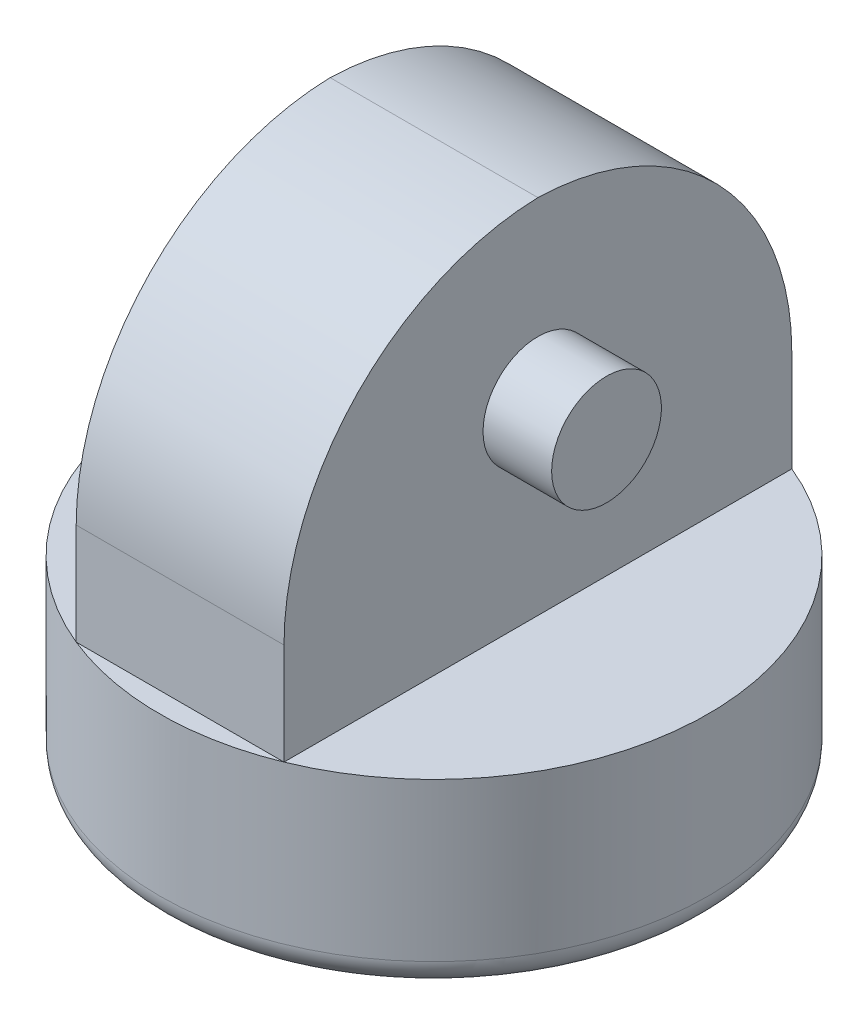
ISO-10303-21;
HEADER;
FILE_DESCRIPTION(('STEP AP214'),'2;1');
FILE_NAME('part.step','',(''),(''),'','','');
FILE_SCHEMA(('AUTOMOTIVE_DESIGN { 1 0 10303 214 1 1 1 1 }'));
ENDSEC;
DATA;
#1=APPLICATION_CONTEXT('core data for automotive mechanical design processes');
#2=APPLICATION_PROTOCOL_DEFINITION('international standard','automotive_design',2000,#1);
#3=PRODUCT_CONTEXT('',#1,'mechanical');
#4=PRODUCT('Part','Part','',(#3));
#5=PRODUCT_RELATED_PRODUCT_CATEGORY('part','',(#4));
#6=PRODUCT_DEFINITION_FORMATION('','',#4);
#7=PRODUCT_DEFINITION_CONTEXT('part definition',#1,'design');
#8=PRODUCT_DEFINITION('design','',#6,#7);
#9=PRODUCT_DEFINITION_SHAPE('','',#8);
#10=(LENGTH_UNIT() NAMED_UNIT(*) SI_UNIT(.MILLI.,.METRE.));
#11=(NAMED_UNIT(*) PLANE_ANGLE_UNIT() SI_UNIT($,.RADIAN.));
#12=(NAMED_UNIT(*) SI_UNIT($,.STERADIAN.) SOLID_ANGLE_UNIT());
#13=UNCERTAINTY_MEASURE_WITH_UNIT(LENGTH_MEASURE(1.E-05),#10,'distance_accuracy_value','');
#14=(GEOMETRIC_REPRESENTATION_CONTEXT(3) GLOBAL_UNCERTAINTY_ASSIGNED_CONTEXT((#13)) GLOBAL_UNIT_ASSIGNED_CONTEXT((#10,
#11,#12)) REPRESENTATION_CONTEXT('',''));
#15=CARTESIAN_POINT('',(0.,0.,0.));
#16=DIRECTION('',(0.,0.,1.));
#17=DIRECTION('',(1.,0.,0.));
#18=AXIS2_PLACEMENT_3D('',#15,#16,#17);
#19=CARTESIAN_POINT('',(0.,13.5,0.));
#20=DIRECTION('',(0.,1.,0.));
#21=DIRECTION('',(0.,0.,1.));
#22=AXIS2_PLACEMENT_3D('',#19,#20,#21);
#23=PLANE('',#22);
#24=DIRECTION('',(0.,0.,-1.));
#25=VECTOR('',#24,1.);
#26=CARTESIAN_POINT('',(7.57473394696736,13.5,-18.5100892929413));
#27=LINE('',#26,#25);
#28=CARTESIAN_POINT('',(7.57473394696736,13.5,18.5100892929413));
#29=VERTEX_POINT('',#28);
#30=CARTESIAN_POINT('',(7.57473394696736,13.5,-18.5100892929413));
#31=VERTEX_POINT('',#30);
#32=EDGE_CURVE('E126',#29,#31,#27,.T.);
#33=ORIENTED_EDGE('',*,*,#32,.F.);
#34=CARTESIAN_POINT('',(0.,13.5,0.));
#35=DIRECTION('',(0.,1.,0.));
#36=DIRECTION('',(0.,0.,1.));
#37=AXIS2_PLACEMENT_3D('',#34,#35,#36);
#38=CIRCLE('',#37,20.);
#39=EDGE_CURVE('E109',#29,#31,#38,.T.);
#40=ORIENTED_EDGE('',*,*,#39,.T.);
#41=EDGE_LOOP('',(#33,#40));
#42=FACE_BOUND('',#41,.T.);
#43=ADVANCED_FACE('F43',(#42),#23,.T.);
#44=DIRECTION('',(1.,0.,0.));
#45=VECTOR('',#44,1.);
#46=CARTESIAN_POINT('',(-7.57473394696736,13.5,18.5100892929413));
#47=LINE('',#46,#45);
#48=CARTESIAN_POINT('',(-7.57473394696736,13.5,18.5100892929413));
#49=VERTEX_POINT('',#48);
#50=EDGE_CURVE('E121',#49,#29,#47,.T.);
#51=ORIENTED_EDGE('',*,*,#50,.F.);
#52=EDGE_CURVE('E116',#49,#29,#38,.T.);
#53=ORIENTED_EDGE('',*,*,#52,.T.);
#54=EDGE_LOOP('',(#51,#53));
#55=FACE_BOUND('',#54,.T.);
#56=ADVANCED_FACE('F174',(#55),#23,.T.);
#57=DIRECTION('',(0.,0.,1.));
#58=VECTOR('',#57,1.);
#59=CARTESIAN_POINT('',(-7.57473394696736,13.5,-18.5100892929413));
#60=LINE('',#59,#58);
#61=CARTESIAN_POINT('',(-7.57473394696736,13.5,-18.5100892929413));
#62=VERTEX_POINT('',#61);
#63=EDGE_CURVE('E90',#62,#49,#60,.T.);
#64=ORIENTED_EDGE('',*,*,#63,.F.);
#65=EDGE_CURVE('E110',#62,#49,#38,.T.);
#66=ORIENTED_EDGE('',*,*,#65,.T.);
#67=EDGE_LOOP('',(#64,#66));
#68=FACE_BOUND('',#67,.T.);
#69=ADVANCED_FACE('F119',(#68),#23,.T.);
#70=CARTESIAN_POINT('',(0.,13.5,0.));
#71=DIRECTION('',(0.,-1.,0.));
#72=DIRECTION('',(0.,0.,-1.));
#73=AXIS2_PLACEMENT_3D('',#70,#71,#72);
#74=CYLINDRICAL_SURFACE('',#73,20.);
#75=CARTESIAN_POINT('',(0.,2.,0.));
#76=DIRECTION('',(0.,1.,0.));
#77=DIRECTION('',(0.,0.,1.));
#78=AXIS2_PLACEMENT_3D('',#75,#76,#77);
#79=CIRCLE('',#78,20.);
#80=CARTESIAN_POINT('',(0.,2.,20.));
#81=VERTEX_POINT('',#80);
#82=EDGE_CURVE('E145',#81,#81,#79,.T.);
#83=ORIENTED_EDGE('',*,*,#82,.T.);
#84=EDGE_LOOP('',(#83));
#85=FACE_BOUND('',#84,.T.);
#86=ORIENTED_EDGE('',*,*,#39,.F.);
#87=ORIENTED_EDGE('',*,*,#52,.F.);
#88=ORIENTED_EDGE('',*,*,#65,.F.);
#89=EDGE_CURVE('E101',#31,#62,#38,.T.);
#90=ORIENTED_EDGE('',*,*,#89,.F.);
#91=EDGE_LOOP('',(#86,#87,#88,#90));
#92=FACE_BOUND('',#91,.T.);
#93=ADVANCED_FACE('F114',(#85,#92),#74,.T.);
#94=DIRECTION('',(-1.,0.,0.));
#95=VECTOR('',#94,1.);
#96=CARTESIAN_POINT('',(-7.57473394696736,13.5,-18.5100892929413));
#97=LINE('',#96,#95);
#98=EDGE_CURVE('E104',#31,#62,#97,.T.);
#99=ORIENTED_EDGE('',*,*,#98,.F.);
#100=ORIENTED_EDGE('',*,*,#89,.T.);
#101=EDGE_LOOP('',(#99,#100));
#102=FACE_BOUND('',#101,.T.);
#103=ADVANCED_FACE('F103',(#102),#23,.T.);
#104=CARTESIAN_POINT('',(0.,0.,0.));
#105=DIRECTION('',(0.,1.,0.));
#106=DIRECTION('',(0.,0.,1.));
#107=AXIS2_PLACEMENT_3D('',#104,#105,#106);
#108=PLANE('',#107);
#109=CARTESIAN_POINT('',(0.,0.,0.));
#110=DIRECTION('',(0.,1.,0.));
#111=DIRECTION('',(0.,0.,1.));
#112=AXIS2_PLACEMENT_3D('',#109,#110,#111);
#113=CIRCLE('',#112,18.);
#114=CARTESIAN_POINT('',(0.,0.,18.));
#115=VERTEX_POINT('',#114);
#116=EDGE_CURVE('E149',#115,#115,#113,.F.);
#117=ORIENTED_EDGE('',*,*,#116,.T.);
#118=EDGE_LOOP('',(#117));
#119=FACE_BOUND('',#118,.T.);
#120=ADVANCED_FACE('F228',(#119),#108,.F.);
#121=CARTESIAN_POINT('',(0.,2.,0.));
#122=DIRECTION('',(0.,1.,0.));
#123=DIRECTION('',(0.,0.,1.));
#124=AXIS2_PLACEMENT_3D('',#121,#122,#123);
#125=TOROIDAL_SURFACE('',#124,18.,2.);
#126=ORIENTED_EDGE('',*,*,#116,.F.);
#127=EDGE_LOOP('',(#126));
#128=FACE_BOUND('',#127,.T.);
#129=ORIENTED_EDGE('',*,*,#82,.F.);
#130=EDGE_LOOP('',(#129));
#131=FACE_BOUND('',#130,.T.);
#132=ADVANCED_FACE('F233',(#128,#131),#125,.T.);
#133=CARTESIAN_POINT('',(7.57473394696736,39.89,-18.5100892929413));
#134=DIRECTION('',(-1.,0.,0.));
#135=DIRECTION('',(0.,0.,1.));
#136=AXIS2_PLACEMENT_3D('',#133,#134,#135);
#137=PLANE('',#136);
#138=CARTESIAN_POINT('',(7.57473394696736,27.11,0.));
#139=DIRECTION('',(-1.,0.,0.));
#140=DIRECTION('',(0.,0.,1.));
#141=AXIS2_PLACEMENT_3D('',#138,#139,#140);
#142=CIRCLE('',#141,4.);
#143=CARTESIAN_POINT('',(7.57473394696736,27.11,4.));
#144=VERTEX_POINT('',#143);
#145=EDGE_CURVE('E130',#144,#144,#142,.T.);
#146=ORIENTED_EDGE('',*,*,#145,.T.);
#147=EDGE_LOOP('',(#146));
#148=FACE_BOUND('',#147,.T.);
#149=CARTESIAN_POINT('',(7.57473394696736,20.89,0.489910707058696));
#150=DIRECTION('',(-1.,0.,0.));
#151=DIRECTION('',(0.,0.,1.));
#152=AXIS2_PLACEMENT_3D('',#149,#150,#151);
#153=CIRCLE('',#152,19.);
#154=CARTESIAN_POINT('',(7.57473394696736,20.89,-18.5100892929413));
#155=VERTEX_POINT('',#154);
#156=CARTESIAN_POINT('',(7.57473394696736,39.8836828313813,0.));
#157=VERTEX_POINT('',#156);
#158=EDGE_CURVE('E153',#155,#157,#153,.F.);
#159=ORIENTED_EDGE('',*,*,#158,.T.);
#160=CARTESIAN_POINT('',(7.57473394696736,20.89,-0.489910707058696));
#161=DIRECTION('',(-1.,0.,0.));
#162=DIRECTION('',(0.,0.,1.));
#163=AXIS2_PLACEMENT_3D('',#160,#161,#162);
#164=CIRCLE('',#163,19.);
#165=CARTESIAN_POINT('',(7.57473394696736,20.89,18.5100892929413));
#166=VERTEX_POINT('',#165);
#167=EDGE_CURVE('E161',#157,#166,#164,.F.);
#168=ORIENTED_EDGE('',*,*,#167,.T.);
#169=DIRECTION('',(0.,-1.,0.));
#170=VECTOR('',#169,1.);
#171=CARTESIAN_POINT('',(7.57473394696736,39.89,18.5100892929413));
#172=LINE('',#171,#170);
#173=EDGE_CURVE('E137',#166,#29,#172,.T.);
#174=ORIENTED_EDGE('',*,*,#173,.T.);
#175=ORIENTED_EDGE('',*,*,#32,.T.);
#176=DIRECTION('',(0.,-1.,0.));
#177=VECTOR('',#176,1.);
#178=CARTESIAN_POINT('',(7.57473394696736,39.89,-18.5100892929413));
#179=LINE('',#178,#177);
#180=EDGE_CURVE('E95',#155,#31,#179,.T.);
#181=ORIENTED_EDGE('',*,*,#180,.F.);
#182=EDGE_LOOP('',(#159,#168,#174,#175,#181));
#183=FACE_BOUND('',#182,.T.);
#184=ADVANCED_FACE('F202',(#148,#183),#137,.F.);
#185=CARTESIAN_POINT('',(-7.57473394696736,39.89,-18.5100892929413));
#186=DIRECTION('',(0.,0.,1.));
#187=DIRECTION('',(1.,0.,0.));
#188=AXIS2_PLACEMENT_3D('',#185,#186,#187);
#189=PLANE('',#188);
#190=DIRECTION('',(0.,-1.,0.));
#191=VECTOR('',#190,1.);
#192=CARTESIAN_POINT('',(-7.57473394696736,39.89,-18.5100892929413));
#193=LINE('',#192,#191);
#194=CARTESIAN_POINT('',(-7.57473394696736,20.89,-18.5100892929413));
#195=VERTEX_POINT('',#194);
#196=EDGE_CURVE('E86',#195,#62,#193,.T.);
#197=ORIENTED_EDGE('',*,*,#196,.F.);
#198=DIRECTION('',(-1.,0.,0.));
#199=VECTOR('',#198,1.);
#200=CARTESIAN_POINT('',(7.57473394696736,20.89,-18.5100892929413));
#201=LINE('',#200,#199);
#202=EDGE_CURVE('E11',#195,#155,#201,.F.);
#203=ORIENTED_EDGE('',*,*,#202,.T.);
#204=ORIENTED_EDGE('',*,*,#180,.T.);
#205=ORIENTED_EDGE('',*,*,#98,.T.);
#206=EDGE_LOOP('',(#197,#203,#204,#205));
#207=FACE_BOUND('',#206,.T.);
#208=ADVANCED_FACE('F123',(#207),#189,.F.);
#209=CARTESIAN_POINT('',(-7.57473394696736,39.89,-18.5100892929413));
#210=DIRECTION('',(1.,0.,0.));
#211=DIRECTION('',(0.,0.,-1.));
#212=AXIS2_PLACEMENT_3D('',#209,#210,#211);
#213=PLANE('',#212);
#214=CARTESIAN_POINT('',(-7.57473394696736,27.11,0.));
#215=DIRECTION('',(1.,0.,0.));
#216=DIRECTION('',(0.,0.,-1.));
#217=AXIS2_PLACEMENT_3D('',#214,#215,#216);
#218=CIRCLE('',#217,4.);
#219=CARTESIAN_POINT('',(-7.57473394696736,27.11,-4.));
#220=VERTEX_POINT('',#219);
#221=EDGE_CURVE('E154',#220,#220,#218,.T.);
#222=ORIENTED_EDGE('',*,*,#221,.T.);
#223=EDGE_LOOP('',(#222));
#224=FACE_BOUND('',#223,.T.);
#225=DIRECTION('',(0.,-1.,0.));
#226=VECTOR('',#225,1.);
#227=CARTESIAN_POINT('',(-7.57473394696736,39.89,18.5100892929413));
#228=LINE('',#227,#226);
#229=CARTESIAN_POINT('',(-7.57473394696736,20.89,18.5100892929413));
#230=VERTEX_POINT('',#229);
#231=EDGE_CURVE('E96',#230,#49,#228,.T.);
#232=ORIENTED_EDGE('',*,*,#231,.F.);
#233=CARTESIAN_POINT('',(-7.57473394696736,20.89,-0.489910707058696));
#234=DIRECTION('',(1.,0.,0.));
#235=DIRECTION('',(0.,0.,-1.));
#236=AXIS2_PLACEMENT_3D('',#233,#234,#235);
#237=CIRCLE('',#236,19.);
#238=CARTESIAN_POINT('',(-7.57473394696736,39.8836828313813,0.));
#239=VERTEX_POINT('',#238);
#240=EDGE_CURVE('E53',#230,#239,#237,.F.);
#241=ORIENTED_EDGE('',*,*,#240,.T.);
#242=CARTESIAN_POINT('',(-7.57473394696736,20.89,0.489910707058696));
#243=DIRECTION('',(1.,0.,0.));
#244=DIRECTION('',(0.,0.,-1.));
#245=AXIS2_PLACEMENT_3D('',#242,#243,#244);
#246=CIRCLE('',#245,19.);
#247=EDGE_CURVE('E63',#239,#195,#246,.F.);
#248=ORIENTED_EDGE('',*,*,#247,.T.);
#249=ORIENTED_EDGE('',*,*,#196,.T.);
#250=ORIENTED_EDGE('',*,*,#63,.T.);
#251=EDGE_LOOP('',(#232,#241,#248,#249,#250));
#252=FACE_BOUND('',#251,.T.);
#253=ADVANCED_FACE('F88',(#224,#252),#213,.F.);
#254=CARTESIAN_POINT('',(-7.57473394696736,39.89,18.5100892929413));
#255=DIRECTION('',(0.,0.,-1.));
#256=DIRECTION('',(-1.,0.,0.));
#257=AXIS2_PLACEMENT_3D('',#254,#255,#256);
#258=PLANE('',#257);
#259=ORIENTED_EDGE('',*,*,#173,.F.);
#260=DIRECTION('',(1.,0.,0.));
#261=VECTOR('',#260,1.);
#262=CARTESIAN_POINT('',(-7.57473394696736,20.89,18.5100892929413));
#263=LINE('',#262,#261);
#264=EDGE_CURVE('E164',#166,#230,#263,.F.);
#265=ORIENTED_EDGE('',*,*,#264,.T.);
#266=ORIENTED_EDGE('',*,*,#231,.T.);
#267=ORIENTED_EDGE('',*,*,#50,.T.);
#268=EDGE_LOOP('',(#259,#265,#266,#267));
#269=FACE_BOUND('',#268,.T.);
#270=ADVANCED_FACE('F179',(#269),#258,.F.);
#271=CARTESIAN_POINT('',(-12.5747339469674,27.11,0.));
#272=DIRECTION('',(-1.,0.,0.));
#273=DIRECTION('',(0.,0.,1.));
#274=AXIS2_PLACEMENT_3D('',#271,#272,#273);
#275=PLANE('',#274);
#276=CARTESIAN_POINT('',(-12.5747339469674,27.11,0.));
#277=DIRECTION('',(-1.,0.,0.));
#278=DIRECTION('',(0.,0.,1.));
#279=AXIS2_PLACEMENT_3D('',#276,#277,#278);
#280=CIRCLE('',#279,4.);
#281=CARTESIAN_POINT('',(-12.5747339469674,27.11,4.));
#282=VERTEX_POINT('',#281);
#283=EDGE_CURVE('E189',#282,#282,#280,.T.);
#284=ORIENTED_EDGE('',*,*,#283,.T.);
#285=EDGE_LOOP('',(#284));
#286=FACE_BOUND('',#285,.T.);
#287=ADVANCED_FACE('F217',(#286),#275,.T.);
#288=CARTESIAN_POINT('',(12.5752660530326,27.11,0.));
#289=DIRECTION('',(-1.,0.,0.));
#290=DIRECTION('',(0.,0.,1.));
#291=AXIS2_PLACEMENT_3D('',#288,#289,#290);
#292=CYLINDRICAL_SURFACE('',#291,4.);
#293=ORIENTED_EDGE('',*,*,#283,.F.);
#294=EDGE_LOOP('',(#293));
#295=FACE_BOUND('',#294,.T.);
#296=ORIENTED_EDGE('',*,*,#221,.F.);
#297=EDGE_LOOP('',(#296));
#298=FACE_BOUND('',#297,.T.);
#299=ADVANCED_FACE('F208',(#295,#298),#292,.T.);
#300=CARTESIAN_POINT('',(12.5752660530326,27.11,0.));
#301=DIRECTION('',(-1.,0.,0.));
#302=DIRECTION('',(0.,0.,1.));
#303=AXIS2_PLACEMENT_3D('',#300,#301,#302);
#304=CIRCLE('',#303,4.);
#305=CARTESIAN_POINT('',(12.5752660530326,27.11,4.));
#306=VERTEX_POINT('',#305);
#307=EDGE_CURVE('E158',#306,#306,#304,.T.);
#308=ORIENTED_EDGE('',*,*,#307,.T.);
#309=EDGE_LOOP('',(#308));
#310=FACE_BOUND('',#309,.T.);
#311=ORIENTED_EDGE('',*,*,#145,.F.);
#312=EDGE_LOOP('',(#311));
#313=FACE_BOUND('',#312,.T.);
#314=ADVANCED_FACE('F205',(#310,#313),#292,.T.);
#315=CARTESIAN_POINT('',(12.5752660530326,27.11,0.));
#316=DIRECTION('',(-1.,0.,0.));
#317=DIRECTION('',(0.,0.,1.));
#318=AXIS2_PLACEMENT_3D('',#315,#316,#317);
#319=PLANE('',#318);
#320=ORIENTED_EDGE('',*,*,#307,.F.);
#321=EDGE_LOOP('',(#320));
#322=FACE_BOUND('',#321,.T.);
#323=ADVANCED_FACE('F207',(#322),#319,.F.);
#324=CARTESIAN_POINT('',(0.,20.89,0.489910707058696));
#325=DIRECTION('',(1.,0.,0.));
#326=DIRECTION('',(0.,0.,-1.));
#327=AXIS2_PLACEMENT_3D('',#324,#325,#326);
#328=CYLINDRICAL_SURFACE('',#327,19.);
#329=ORIENTED_EDGE('',*,*,#202,.F.);
#330=ORIENTED_EDGE('',*,*,#247,.F.);
#331=DIRECTION('',(1.,0.,0.));
#332=VECTOR('',#331,1.);
#333=CARTESIAN_POINT('',(0.,39.8836828313813,0.));
#334=LINE('',#333,#332);
#335=EDGE_CURVE('E47',#157,#239,#334,.F.);
#336=ORIENTED_EDGE('',*,*,#335,.F.);
#337=ORIENTED_EDGE('',*,*,#158,.F.);
#338=EDGE_LOOP('',(#329,#330,#336,#337));
#339=FACE_BOUND('',#338,.T.);
#340=ADVANCED_FACE('F45',(#339),#328,.T.);
#341=CARTESIAN_POINT('',(0.,20.89,-0.489910707058696));
#342=DIRECTION('',(-1.,0.,0.));
#343=DIRECTION('',(0.,0.,1.));
#344=AXIS2_PLACEMENT_3D('',#341,#342,#343);
#345=CYLINDRICAL_SURFACE('',#344,19.);
#346=ORIENTED_EDGE('',*,*,#240,.F.);
#347=ORIENTED_EDGE('',*,*,#264,.F.);
#348=ORIENTED_EDGE('',*,*,#167,.F.);
#349=ORIENTED_EDGE('',*,*,#335,.T.);
#350=EDGE_LOOP('',(#346,#347,#348,#349));
#351=FACE_BOUND('',#350,.T.);
#352=ADVANCED_FACE('F183',(#351),#345,.T.);
#353=CLOSED_SHELL('',(#43,#56,#69,#93,#103,#120,#132,#184,#208,#253,#270,#287,#299,#314,#323,
#340,#352));
#354=MANIFOLD_SOLID_BREP('B2',#353);
#355=ADVANCED_BREP_SHAPE_REPRESENTATION('',(#18,#354),#14);
#356=SHAPE_DEFINITION_REPRESENTATION(#9,#355);
ENDSEC;
END-ISO-10303-21;
